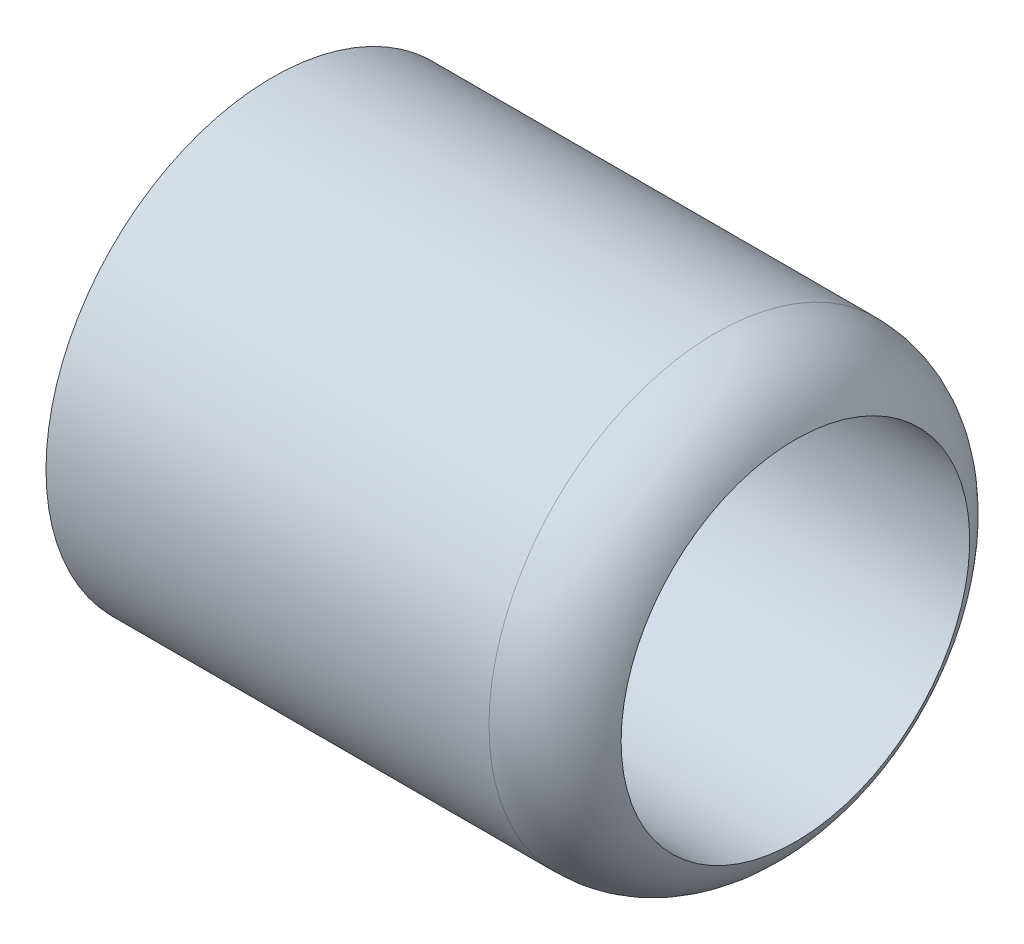
ISO-10303-21;
HEADER;
FILE_DESCRIPTION(('STEP AP214'),'2;1');
FILE_NAME('part.step','',(''),(''),'','','');
FILE_SCHEMA(('AUTOMOTIVE_DESIGN { 1 0 10303 214 1 1 1 1 }'));
ENDSEC;
DATA;
#1=APPLICATION_CONTEXT('core data for automotive mechanical design processes');
#2=APPLICATION_PROTOCOL_DEFINITION('international standard','automotive_design',2000,#1);
#3=PRODUCT_CONTEXT('',#1,'mechanical');
#4=PRODUCT('Part','Part','',(#3));
#5=PRODUCT_RELATED_PRODUCT_CATEGORY('part','',(#4));
#6=PRODUCT_DEFINITION_FORMATION('','',#4);
#7=PRODUCT_DEFINITION_CONTEXT('part definition',#1,'design');
#8=PRODUCT_DEFINITION('design','',#6,#7);
#9=PRODUCT_DEFINITION_SHAPE('','',#8);
#10=(LENGTH_UNIT() NAMED_UNIT(*) SI_UNIT(.MILLI.,.METRE.));
#11=(NAMED_UNIT(*) PLANE_ANGLE_UNIT() SI_UNIT($,.RADIAN.));
#12=(NAMED_UNIT(*) SI_UNIT($,.STERADIAN.) SOLID_ANGLE_UNIT());
#13=UNCERTAINTY_MEASURE_WITH_UNIT(LENGTH_MEASURE(1.E-05),#10,'distance_accuracy_value','');
#14=(GEOMETRIC_REPRESENTATION_CONTEXT(3) GLOBAL_UNCERTAINTY_ASSIGNED_CONTEXT((#13)) GLOBAL_UNIT_ASSIGNED_CONTEXT((#10,
#11,#12)) REPRESENTATION_CONTEXT('',''));
#15=CARTESIAN_POINT('',(0.,0.,0.));
#16=DIRECTION('',(0.,0.,1.));
#17=DIRECTION('',(1.,0.,0.));
#18=AXIS2_PLACEMENT_3D('',#15,#16,#17);
#19=CARTESIAN_POINT('',(0.,3.81,0.));
#20=DIRECTION('',(1.,0.,0.));
#21=DIRECTION('',(0.,0.,-1.));
#22=AXIS2_PLACEMENT_3D('',#19,#20,#21);
#23=PLANE('',#22);
#24=CARTESIAN_POINT('',(0.,-12.7,0.));
#25=DIRECTION('',(1.,0.,0.));
#26=DIRECTION('',(0.,0.,-1.));
#27=AXIS2_PLACEMENT_3D('',#24,#25,#26);
#28=CIRCLE('',#27,14.224);
#29=CARTESIAN_POINT('',(0.,-12.7,-14.224));
#30=VERTEX_POINT('',#29);
#31=EDGE_CURVE('E10',#30,#30,#28,.T.);
#32=ORIENTED_EDGE('',*,*,#31,.T.);
#33=EDGE_LOOP('',(#32));
#34=FACE_BOUND('',#33,.T.);
#35=CARTESIAN_POINT('',(0.,-12.7,0.));
#36=DIRECTION('',(-1.,0.,0.));
#37=DIRECTION('',(0.,0.,1.));
#38=AXIS2_PLACEMENT_3D('',#35,#36,#37);
#39=CIRCLE('',#38,16.51);
#40=CARTESIAN_POINT('',(0.,-12.7,16.51));
#41=VERTEX_POINT('',#40);
#42=EDGE_CURVE('E42',#41,#41,#39,.T.);
#43=ORIENTED_EDGE('',*,*,#42,.T.);
#44=EDGE_LOOP('',(#43));
#45=FACE_BOUND('',#44,.T.);
#46=ADVANCED_FACE('F31',(#34,#45),#23,.F.);
#47=CARTESIAN_POINT('',(-29.8189598133346,-12.7,0.));
#48=DIRECTION('',(-1.,0.,0.));
#49=DIRECTION('',(0.,0.,1.));
#50=AXIS2_PLACEMENT_3D('',#47,#48,#49);
#51=CYLINDRICAL_SURFACE('',#50,16.51);
#52=ORIENTED_EDGE('',*,*,#42,.F.);
#53=EDGE_LOOP('',(#52));
#54=FACE_BOUND('',#53,.T.);
#55=CARTESIAN_POINT('',(32.2801288674061,-12.7,0.));
#56=DIRECTION('',(-1.,0.,0.));
#57=DIRECTION('',(0.,0.,1.));
#58=AXIS2_PLACEMENT_3D('',#55,#56,#57);
#59=CIRCLE('',#58,16.51);
#60=CARTESIAN_POINT('',(32.2801288674061,-12.7,16.51));
#61=VERTEX_POINT('',#60);
#62=EDGE_CURVE('E46',#61,#61,#59,.T.);
#63=ORIENTED_EDGE('',*,*,#62,.T.);
#64=EDGE_LOOP('',(#63));
#65=FACE_BOUND('',#64,.T.);
#66=ADVANCED_FACE('F81',(#54,#65),#51,.T.);
#67=CARTESIAN_POINT('',(32.2801288674061,-12.7,0.));
#68=DIRECTION('',(-1.,0.,0.));
#69=DIRECTION('',(0.,0.,1.));
#70=AXIS2_PLACEMENT_3D('',#67,#68,#69);
#71=TOROIDAL_SURFACE('',#70,10.16,6.35);
#72=ORIENTED_EDGE('',*,*,#62,.F.);
#73=EDGE_LOOP('',(#72));
#74=FACE_BOUND('',#73,.T.);
#75=CARTESIAN_POINT('',(38.1,-12.7,0.));
#76=DIRECTION('',(-1.,0.,0.));
#77=DIRECTION('',(0.,0.,1.));
#78=AXIS2_PLACEMENT_3D('',#75,#76,#77);
#79=CIRCLE('',#78,12.7);
#80=CARTESIAN_POINT('',(38.1,-12.7,12.7));
#81=VERTEX_POINT('',#80);
#82=EDGE_CURVE('E51',#81,#81,#79,.T.);
#83=ORIENTED_EDGE('',*,*,#82,.T.);
#84=EDGE_LOOP('',(#83));
#85=FACE_BOUND('',#84,.T.);
#86=ADVANCED_FACE('F85',(#74,#85),#71,.T.);
#87=CARTESIAN_POINT('',(-29.8189598133346,-12.7,0.));
#88=DIRECTION('',(-1.,0.,0.));
#89=DIRECTION('',(0.,0.,1.));
#90=AXIS2_PLACEMENT_3D('',#87,#88,#89);
#91=CYLINDRICAL_SURFACE('',#90,12.7);
#92=ORIENTED_EDGE('',*,*,#82,.F.);
#93=EDGE_LOOP('',(#92));
#94=FACE_BOUND('',#93,.T.);
#95=CARTESIAN_POINT('',(19.05,-12.7,0.));
#96=DIRECTION('',(-1.,0.,0.));
#97=DIRECTION('',(0.,0.,1.));
#98=AXIS2_PLACEMENT_3D('',#95,#96,#97);
#99=CIRCLE('',#98,12.7);
#100=CARTESIAN_POINT('',(19.05,-12.7,12.7));
#101=VERTEX_POINT('',#100);
#102=EDGE_CURVE('E54',#101,#101,#99,.T.);
#103=ORIENTED_EDGE('',*,*,#102,.T.);
#104=EDGE_LOOP('',(#103));
#105=FACE_BOUND('',#104,.T.);
#106=ADVANCED_FACE('F92',(#94,#105),#91,.F.);
#107=CARTESIAN_POINT('',(19.05,0.,0.));
#108=DIRECTION('',(-1.,0.,0.));
#109=DIRECTION('',(0.,0.,1.));
#110=AXIS2_PLACEMENT_3D('',#107,#108,#109);
#111=PLANE('',#110);
#112=ORIENTED_EDGE('',*,*,#102,.F.);
#113=EDGE_LOOP('',(#112));
#114=FACE_BOUND('',#113,.T.);
#115=CARTESIAN_POINT('',(19.05,-12.7,0.));
#116=DIRECTION('',(-1.,0.,0.));
#117=DIRECTION('',(0.,0.,1.));
#118=AXIS2_PLACEMENT_3D('',#115,#116,#117);
#119=CIRCLE('',#118,8.128);
#120=CARTESIAN_POINT('',(19.05,-12.7,8.128));
#121=VERTEX_POINT('',#120);
#122=EDGE_CURVE('E57',#121,#121,#119,.T.);
#123=ORIENTED_EDGE('',*,*,#122,.T.);
#124=EDGE_LOOP('',(#123));
#125=FACE_BOUND('',#124,.T.);
#126=ADVANCED_FACE('F96',(#114,#125),#111,.F.);
#127=CARTESIAN_POINT('',(-29.8189598133346,-12.7,0.));
#128=DIRECTION('',(-1.,0.,0.));
#129=DIRECTION('',(0.,0.,1.));
#130=AXIS2_PLACEMENT_3D('',#127,#128,#129);
#131=CYLINDRICAL_SURFACE('',#130,8.128);
#132=ORIENTED_EDGE('',*,*,#122,.F.);
#133=EDGE_LOOP('',(#132));
#134=FACE_BOUND('',#133,.T.);
#135=CARTESIAN_POINT('',(12.7,-12.7,0.));
#136=DIRECTION('',(-1.,0.,0.));
#137=DIRECTION('',(0.,0.,1.));
#138=AXIS2_PLACEMENT_3D('',#135,#136,#137);
#139=CIRCLE('',#138,8.128);
#140=CARTESIAN_POINT('',(12.7,-12.7,8.128));
#141=VERTEX_POINT('',#140);
#142=EDGE_CURVE('E60',#141,#141,#139,.T.);
#143=ORIENTED_EDGE('',*,*,#142,.T.);
#144=EDGE_LOOP('',(#143));
#145=FACE_BOUND('',#144,.T.);
#146=ADVANCED_FACE('F77',(#134,#145),#131,.F.);
#147=CARTESIAN_POINT('',(12.7,-4.572,0.));
#148=DIRECTION('',(1.,0.,0.));
#149=DIRECTION('',(0.,0.,-1.));
#150=AXIS2_PLACEMENT_3D('',#147,#148,#149);
#151=PLANE('',#150);
#152=ORIENTED_EDGE('',*,*,#142,.F.);
#153=EDGE_LOOP('',(#152));
#154=FACE_BOUND('',#153,.T.);
#155=CARTESIAN_POINT('',(12.7,-12.7,0.));
#156=DIRECTION('',(-1.,0.,0.));
#157=DIRECTION('',(0.,0.,1.));
#158=AXIS2_PLACEMENT_3D('',#155,#156,#157);
#159=CIRCLE('',#158,12.7);
#160=CARTESIAN_POINT('',(12.7,-12.7,12.7));
#161=VERTEX_POINT('',#160);
#162=EDGE_CURVE('E63',#161,#161,#159,.T.);
#163=ORIENTED_EDGE('',*,*,#162,.T.);
#164=EDGE_LOOP('',(#163));
#165=FACE_BOUND('',#164,.T.);
#166=ADVANCED_FACE('F67',(#154,#165),#151,.F.);
#167=CARTESIAN_POINT('',(-29.8189598133346,-12.7,0.));
#168=DIRECTION('',(-1.,0.,0.));
#169=DIRECTION('',(0.,0.,1.));
#170=AXIS2_PLACEMENT_3D('',#167,#168,#169);
#171=CYLINDRICAL_SURFACE('',#170,12.7);
#172=CARTESIAN_POINT('',(1.524,-12.7,0.));
#173=DIRECTION('',(1.,0.,0.));
#174=DIRECTION('',(0.,0.,-1.));
#175=AXIS2_PLACEMENT_3D('',#172,#173,#174);
#176=CIRCLE('',#175,12.7);
#177=CARTESIAN_POINT('',(1.524,-12.7,-12.7));
#178=VERTEX_POINT('',#177);
#179=EDGE_CURVE('E38',#178,#178,#176,.F.);
#180=ORIENTED_EDGE('',*,*,#179,.T.);
#181=EDGE_LOOP('',(#180));
#182=FACE_BOUND('',#181,.T.);
#183=ORIENTED_EDGE('',*,*,#162,.F.);
#184=EDGE_LOOP('',(#183));
#185=FACE_BOUND('',#184,.T.);
#186=ADVANCED_FACE('F69',(#182,#185),#171,.F.);
#187=CARTESIAN_POINT('',(1.524,-12.7,0.));
#188=DIRECTION('',(-1.,0.,0.));
#189=DIRECTION('',(0.,0.,1.));
#190=AXIS2_PLACEMENT_3D('',#187,#188,#189);
#191=CONICAL_SURFACE('',#190,12.7,0.785398163397448);
#192=ORIENTED_EDGE('',*,*,#31,.F.);
#193=EDGE_LOOP('',(#192));
#194=FACE_BOUND('',#193,.T.);
#195=ORIENTED_EDGE('',*,*,#179,.F.);
#196=EDGE_LOOP('',(#195));
#197=FACE_BOUND('',#196,.T.);
#198=ADVANCED_FACE('F33',(#194,#197),#191,.F.);
#199=CLOSED_SHELL('',(#46,#66,#86,#106,#126,#146,#166,#186,#198));
#200=MANIFOLD_SOLID_BREP('B2',#199);
#201=ADVANCED_BREP_SHAPE_REPRESENTATION('',(#18,#200),#14);
#202=SHAPE_DEFINITION_REPRESENTATION(#9,#201);
ENDSEC;
END-ISO-10303-21;
